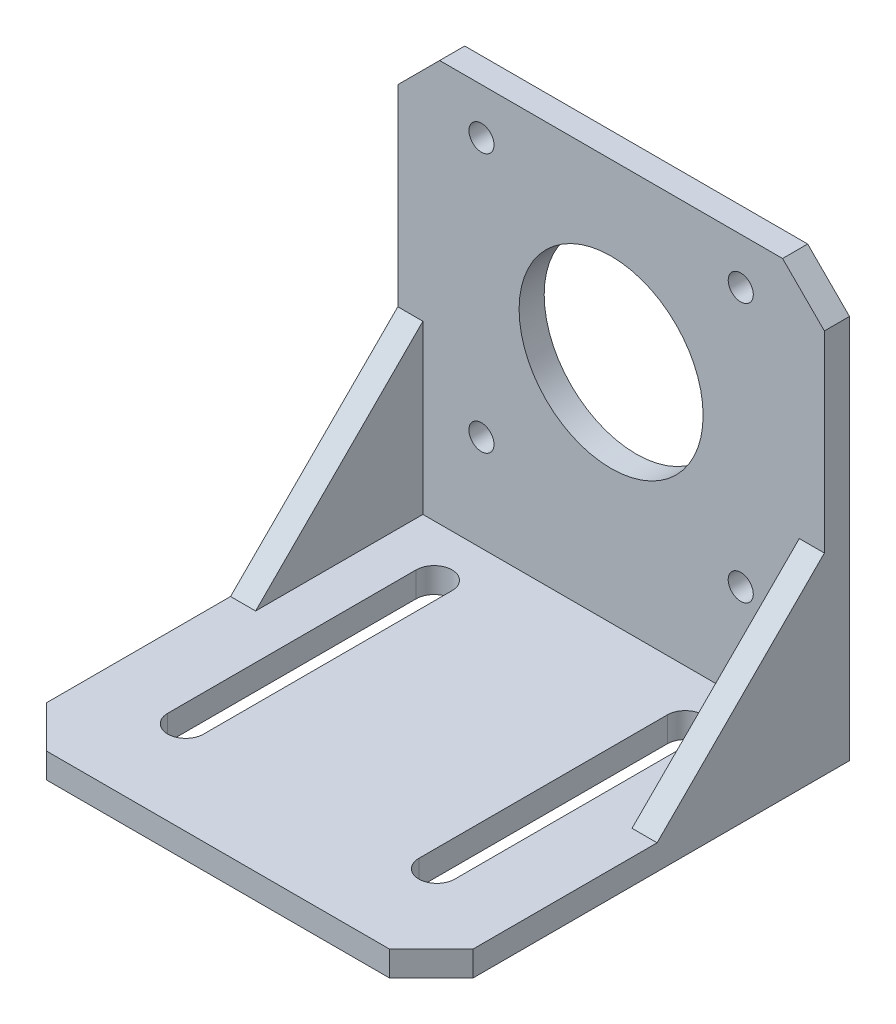
ISO-10303-21;
HEADER;
FILE_DESCRIPTION(('STEP AP214'),'2;1');
FILE_NAME('part.step','',(''),(''),'','','');
FILE_SCHEMA(('AUTOMOTIVE_DESIGN { 1 0 10303 214 1 1 1 1 }'));
ENDSEC;
DATA;
#1=APPLICATION_CONTEXT('core data for automotive mechanical design processes');
#2=APPLICATION_PROTOCOL_DEFINITION('international standard','automotive_design',2000,#1);
#3=PRODUCT_CONTEXT('',#1,'mechanical');
#4=PRODUCT('Part','Part','',(#3));
#5=PRODUCT_RELATED_PRODUCT_CATEGORY('part','',(#4));
#6=PRODUCT_DEFINITION_FORMATION('','',#4);
#7=PRODUCT_DEFINITION_CONTEXT('part definition',#1,'design');
#8=PRODUCT_DEFINITION('design','',#6,#7);
#9=PRODUCT_DEFINITION_SHAPE('','',#8);
#10=(LENGTH_UNIT() NAMED_UNIT(*) SI_UNIT(.MILLI.,.METRE.));
#11=(NAMED_UNIT(*) PLANE_ANGLE_UNIT() SI_UNIT($,.RADIAN.));
#12=(NAMED_UNIT(*) SI_UNIT($,.STERADIAN.) SOLID_ANGLE_UNIT());
#13=UNCERTAINTY_MEASURE_WITH_UNIT(LENGTH_MEASURE(1.E-05),#10,'distance_accuracy_value','');
#14=(GEOMETRIC_REPRESENTATION_CONTEXT(3) GLOBAL_UNCERTAINTY_ASSIGNED_CONTEXT((#13)) GLOBAL_UNIT_ASSIGNED_CONTEXT((#10,
#11,#12)) REPRESENTATION_CONTEXT('',''));
#15=CARTESIAN_POINT('',(0.,0.,0.));
#16=DIRECTION('',(0.,0.,1.));
#17=DIRECTION('',(1.,0.,0.));
#18=AXIS2_PLACEMENT_3D('',#15,#16,#17);
#19=CARTESIAN_POINT('',(0.,3.,0.));
#20=DIRECTION('',(0.,1.,0.));
#21=DIRECTION('',(0.,0.,1.));
#22=AXIS2_PLACEMENT_3D('',#19,#20,#21);
#23=PLANE('',#22);
#24=DIRECTION('',(0.,0.,1.));
#25=VECTOR('',#24,1.);
#26=CARTESIAN_POINT('',(-17.165,3.,-15.85));
#27=LINE('',#26,#25);
#28=CARTESIAN_POINT('',(-17.165,3.,-15.85));
#29=VERTEX_POINT('',#28);
#30=CARTESIAN_POINT('',(-17.165,3.,13.85));
#31=VERTEX_POINT('',#30);
#32=EDGE_CURVE('E301',#29,#31,#27,.T.);
#33=ORIENTED_EDGE('',*,*,#32,.F.);
#34=CARTESIAN_POINT('',(-15.015,3.,-15.85));
#35=DIRECTION('',(0.,1.,0.));
#36=DIRECTION('',(0.,0.,1.));
#37=AXIS2_PLACEMENT_3D('',#34,#35,#36);
#38=CIRCLE('',#37,2.14999999999999);
#39=CARTESIAN_POINT('',(-12.865,3.,-15.85));
#40=VERTEX_POINT('',#39);
#41=EDGE_CURVE('E299',#40,#29,#38,.T.);
#42=ORIENTED_EDGE('',*,*,#41,.F.);
#43=DIRECTION('',(0.,0.,-1.));
#44=VECTOR('',#43,1.);
#45=CARTESIAN_POINT('',(-12.865,3.,-15.85));
#46=LINE('',#45,#44);
#47=CARTESIAN_POINT('',(-12.865,3.,13.85));
#48=VERTEX_POINT('',#47);
#49=EDGE_CURVE('E307',#48,#40,#46,.T.);
#50=ORIENTED_EDGE('',*,*,#49,.F.);
#51=CARTESIAN_POINT('',(-15.015,3.,13.85));
#52=DIRECTION('',(0.,1.,0.));
#53=DIRECTION('',(0.,0.,1.));
#54=AXIS2_PLACEMENT_3D('',#51,#52,#53);
#55=CIRCLE('',#54,2.15000000000001);
#56=EDGE_CURVE('E304',#31,#48,#55,.T.);
#57=ORIENTED_EDGE('',*,*,#56,.F.);
#58=EDGE_LOOP('',(#33,#42,#50,#57));
#59=FACE_BOUND('',#58,.T.);
#60=DIRECTION('',(0.,0.,1.));
#61=VECTOR('',#60,1.);
#62=CARTESIAN_POINT('',(12.865,3.,-15.85));
#63=LINE('',#62,#61);
#64=CARTESIAN_POINT('',(12.865,3.,-15.85));
#65=VERTEX_POINT('',#64);
#66=CARTESIAN_POINT('',(12.865,3.,13.85));
#67=VERTEX_POINT('',#66);
#68=EDGE_CURVE('E270',#65,#67,#63,.T.);
#69=ORIENTED_EDGE('',*,*,#68,.F.);
#70=CARTESIAN_POINT('',(15.015,3.,-15.85));
#71=DIRECTION('',(0.,1.,0.));
#72=DIRECTION('',(0.,0.,-1.));
#73=AXIS2_PLACEMENT_3D('',#70,#71,#72);
#74=CIRCLE('',#73,2.14999999999999);
#75=CARTESIAN_POINT('',(17.165,3.,-15.85));
#76=VERTEX_POINT('',#75);
#77=EDGE_CURVE('E268',#76,#65,#74,.T.);
#78=ORIENTED_EDGE('',*,*,#77,.F.);
#79=DIRECTION('',(0.,0.,-1.));
#80=VECTOR('',#79,1.);
#81=CARTESIAN_POINT('',(17.165,3.,-15.85));
#82=LINE('',#81,#80);
#83=CARTESIAN_POINT('',(17.165,3.,13.85));
#84=VERTEX_POINT('',#83);
#85=EDGE_CURVE('E276',#84,#76,#82,.T.);
#86=ORIENTED_EDGE('',*,*,#85,.F.);
#87=CARTESIAN_POINT('',(15.015,3.,13.85));
#88=DIRECTION('',(0.,1.,0.));
#89=DIRECTION('',(0.,0.,-1.));
#90=AXIS2_PLACEMENT_3D('',#87,#88,#89);
#91=CIRCLE('',#90,2.15000000000001);
#92=EDGE_CURVE('E273',#67,#84,#91,.T.);
#93=ORIENTED_EDGE('',*,*,#92,.F.);
#94=EDGE_LOOP('',(#69,#78,#86,#93));
#95=FACE_BOUND('',#94,.T.);
#96=DIRECTION('',(0.,0.,1.));
#97=VECTOR('',#96,1.);
#98=CARTESIAN_POINT('',(-25.5,3.,25.));
#99=LINE('',#98,#97);
#100=CARTESIAN_POINT('',(-25.5,3.,-2.));
#101=VERTEX_POINT('',#100);
#102=CARTESIAN_POINT('',(-25.5,3.,20.));
#103=VERTEX_POINT('',#102);
#104=EDGE_CURVE('E330',#101,#103,#99,.T.);
#105=ORIENTED_EDGE('',*,*,#104,.T.);
#106=DIRECTION('',(-0.707106781186546,0.,-0.707106781186549));
#107=VECTOR('',#106,1.);
#108=CARTESIAN_POINT('',(-22.75,3.,22.75));
#109=LINE('',#108,#107);
#110=CARTESIAN_POINT('',(-20.5,3.,25.));
#111=VERTEX_POINT('',#110);
#112=EDGE_CURVE('E369',#103,#111,#109,.F.);
#113=ORIENTED_EDGE('',*,*,#112,.T.);
#114=DIRECTION('',(1.,0.,0.));
#115=VECTOR('',#114,1.);
#116=CARTESIAN_POINT('',(25.5,3.,25.));
#117=LINE('',#116,#115);
#118=CARTESIAN_POINT('',(20.5,3.,25.));
#119=VERTEX_POINT('',#118);
#120=EDGE_CURVE('E333',#111,#119,#117,.T.);
#121=ORIENTED_EDGE('',*,*,#120,.T.);
#122=DIRECTION('',(-0.707106781186549,0.,0.707106781186546));
#123=VECTOR('',#122,1.);
#124=CARTESIAN_POINT('',(22.75,3.,22.75));
#125=LINE('',#124,#123);
#126=CARTESIAN_POINT('',(25.5,3.,20.));
#127=VERTEX_POINT('',#126);
#128=EDGE_CURVE('E367',#119,#127,#125,.F.);
#129=ORIENTED_EDGE('',*,*,#128,.T.);
#130=DIRECTION('',(0.,0.,-1.));
#131=VECTOR('',#130,1.);
#132=CARTESIAN_POINT('',(25.5,3.,25.));
#133=LINE('',#132,#131);
#134=CARTESIAN_POINT('',(25.5,3.,-2.));
#135=VERTEX_POINT('',#134);
#136=EDGE_CURVE('E337',#127,#135,#133,.T.);
#137=ORIENTED_EDGE('',*,*,#136,.T.);
#138=DIRECTION('',(1.,0.,0.));
#139=VECTOR('',#138,1.);
#140=CARTESIAN_POINT('',(22.5,3.,-2.));
#141=LINE('',#140,#139);
#142=CARTESIAN_POINT('',(22.5,3.,-2.));
#143=VERTEX_POINT('',#142);
#144=EDGE_CURVE('E201',#143,#135,#141,.T.);
#145=ORIENTED_EDGE('',*,*,#144,.F.);
#146=DIRECTION('',(0.,0.,1.));
#147=VECTOR('',#146,1.);
#148=CARTESIAN_POINT('',(22.5,3.,-2.));
#149=LINE('',#148,#147);
#150=CARTESIAN_POINT('',(22.5,3.,-22.));
#151=VERTEX_POINT('',#150);
#152=EDGE_CURVE('E190',#151,#143,#149,.T.);
#153=ORIENTED_EDGE('',*,*,#152,.F.);
#154=DIRECTION('',(1.,0.,0.));
#155=VECTOR('',#154,1.);
#156=CARTESIAN_POINT('',(0.,3.,-22.));
#157=LINE('',#156,#155);
#158=CARTESIAN_POINT('',(-22.5,3.,-22.));
#159=VERTEX_POINT('',#158);
#160=EDGE_CURVE('E206',#159,#151,#157,.T.);
#161=ORIENTED_EDGE('',*,*,#160,.F.);
#162=DIRECTION('',(0.,0.,1.));
#163=VECTOR('',#162,1.);
#164=CARTESIAN_POINT('',(-22.5,3.,-2.));
#165=LINE('',#164,#163);
#166=CARTESIAN_POINT('',(-22.5,3.,-2.));
#167=VERTEX_POINT('',#166);
#168=EDGE_CURVE('E215',#159,#167,#165,.T.);
#169=ORIENTED_EDGE('',*,*,#168,.T.);
#170=DIRECTION('',(-1.,0.,0.));
#171=VECTOR('',#170,1.);
#172=CARTESIAN_POINT('',(-22.5,3.,-2.));
#173=LINE('',#172,#171);
#174=EDGE_CURVE('E220',#167,#101,#173,.T.);
#175=ORIENTED_EDGE('',*,*,#174,.T.);
#176=EDGE_LOOP('',(#105,#113,#121,#129,#137,#145,#153,#161,#169,#175));
#177=FACE_BOUND('',#176,.T.);
#178=ADVANCED_FACE('F37',(#59,#95,#177),#23,.T.);
#179=CARTESIAN_POINT('',(-25.5,51.,-22.));
#180=DIRECTION('',(0.,0.,1.));
#181=DIRECTION('',(1.,0.,0.));
#182=AXIS2_PLACEMENT_3D('',#179,#180,#181);
#183=PLANE('',#182);
#184=CARTESIAN_POINT('',(15.5,14.5,-22.));
#185=DIRECTION('',(0.,0.,1.));
#186=DIRECTION('',(1.,0.,0.));
#187=AXIS2_PLACEMENT_3D('',#184,#185,#186);
#188=CIRCLE('',#187,1.5);
#189=CARTESIAN_POINT('',(17.,14.5,-22.));
#190=VERTEX_POINT('',#189);
#191=EDGE_CURVE('E226',#190,#190,#188,.T.);
#192=ORIENTED_EDGE('',*,*,#191,.F.);
#193=EDGE_LOOP('',(#192));
#194=FACE_BOUND('',#193,.T.);
#195=CARTESIAN_POINT('',(-15.5,14.5,-22.));
#196=DIRECTION('',(0.,0.,1.));
#197=DIRECTION('',(-1.,0.,0.));
#198=AXIS2_PLACEMENT_3D('',#195,#196,#197);
#199=CIRCLE('',#198,1.5);
#200=CARTESIAN_POINT('',(-17.,14.5,-22.));
#201=VERTEX_POINT('',#200);
#202=EDGE_CURVE('E244',#201,#201,#199,.T.);
#203=ORIENTED_EDGE('',*,*,#202,.F.);
#204=EDGE_LOOP('',(#203));
#205=FACE_BOUND('',#204,.T.);
#206=CARTESIAN_POINT('',(15.5,45.5,-22.));
#207=DIRECTION('',(0.,0.,1.));
#208=DIRECTION('',(-1.,0.,0.));
#209=AXIS2_PLACEMENT_3D('',#206,#207,#208);
#210=CIRCLE('',#209,1.5);
#211=CARTESIAN_POINT('',(14.,45.5,-22.));
#212=VERTEX_POINT('',#211);
#213=EDGE_CURVE('E238',#212,#212,#210,.T.);
#214=ORIENTED_EDGE('',*,*,#213,.F.);
#215=EDGE_LOOP('',(#214));
#216=FACE_BOUND('',#215,.T.);
#217=CARTESIAN_POINT('',(-15.5,45.5,-22.));
#218=DIRECTION('',(0.,0.,1.));
#219=DIRECTION('',(1.,0.,0.));
#220=AXIS2_PLACEMENT_3D('',#217,#218,#219);
#221=CIRCLE('',#220,1.5);
#222=CARTESIAN_POINT('',(-14.,45.5,-22.));
#223=VERTEX_POINT('',#222);
#224=EDGE_CURVE('E232',#223,#223,#221,.T.);
#225=ORIENTED_EDGE('',*,*,#224,.F.);
#226=EDGE_LOOP('',(#225));
#227=FACE_BOUND('',#226,.T.);
#228=CARTESIAN_POINT('',(0.,30.,-22.));
#229=DIRECTION('',(0.,0.,1.));
#230=DIRECTION('',(1.,0.,0.));
#231=AXIS2_PLACEMENT_3D('',#228,#229,#230);
#232=CIRCLE('',#231,11.);
#233=CARTESIAN_POINT('',(11.,30.,-22.));
#234=VERTEX_POINT('',#233);
#235=EDGE_CURVE('E231',#234,#234,#232,.T.);
#236=ORIENTED_EDGE('',*,*,#235,.F.);
#237=EDGE_LOOP('',(#236));
#238=FACE_BOUND('',#237,.T.);
#239=DIRECTION('',(-1.,0.,0.));
#240=VECTOR('',#239,1.);
#241=CARTESIAN_POINT('',(-25.5,51.,-22.));
#242=LINE('',#241,#240);
#243=CARTESIAN_POINT('',(20.5,51.,-22.));
#244=VERTEX_POINT('',#243);
#245=CARTESIAN_POINT('',(-20.5,51.,-22.));
#246=VERTEX_POINT('',#245);
#247=EDGE_CURVE('E260',#244,#246,#242,.T.);
#248=ORIENTED_EDGE('',*,*,#247,.T.);
#249=DIRECTION('',(-0.707106781186549,-0.707106781186546,0.));
#250=VECTOR('',#249,1.);
#251=CARTESIAN_POINT('',(-23.,48.5,-22.));
#252=LINE('',#251,#250);
#253=CARTESIAN_POINT('',(-25.5,46.,-22.));
#254=VERTEX_POINT('',#253);
#255=EDGE_CURVE('E11',#246,#254,#252,.T.);
#256=ORIENTED_EDGE('',*,*,#255,.T.);
#257=DIRECTION('',(0.,-1.,0.));
#258=VECTOR('',#257,1.);
#259=CARTESIAN_POINT('',(-25.5,51.,-22.));
#260=LINE('',#259,#258);
#261=CARTESIAN_POINT('',(-25.5,23.,-22.));
#262=VERTEX_POINT('',#261);
#263=EDGE_CURVE('E263',#254,#262,#260,.T.);
#264=ORIENTED_EDGE('',*,*,#263,.T.);
#265=DIRECTION('',(-1.,0.,0.));
#266=VECTOR('',#265,1.);
#267=CARTESIAN_POINT('',(-22.5,23.,-22.));
#268=LINE('',#267,#266);
#269=CARTESIAN_POINT('',(-22.5,23.,-22.));
#270=VERTEX_POINT('',#269);
#271=EDGE_CURVE('E223',#270,#262,#268,.T.);
#272=ORIENTED_EDGE('',*,*,#271,.F.);
#273=DIRECTION('',(0.,-1.,0.));
#274=VECTOR('',#273,1.);
#275=CARTESIAN_POINT('',(-22.5,3.,-22.));
#276=LINE('',#275,#274);
#277=EDGE_CURVE('E213',#270,#159,#276,.T.);
#278=ORIENTED_EDGE('',*,*,#277,.T.);
#279=ORIENTED_EDGE('',*,*,#160,.T.);
#280=DIRECTION('',(0.,-1.,0.));
#281=VECTOR('',#280,1.);
#282=CARTESIAN_POINT('',(22.5,3.,-22.));
#283=LINE('',#282,#281);
#284=CARTESIAN_POINT('',(22.5,23.,-22.));
#285=VERTEX_POINT('',#284);
#286=EDGE_CURVE('E188',#285,#151,#283,.T.);
#287=ORIENTED_EDGE('',*,*,#286,.F.);
#288=DIRECTION('',(1.,0.,0.));
#289=VECTOR('',#288,1.);
#290=CARTESIAN_POINT('',(22.5,23.,-22.));
#291=LINE('',#290,#289);
#292=CARTESIAN_POINT('',(25.5,23.,-22.));
#293=VERTEX_POINT('',#292);
#294=EDGE_CURVE('E197',#285,#293,#291,.T.);
#295=ORIENTED_EDGE('',*,*,#294,.T.);
#296=DIRECTION('',(0.,-1.,0.));
#297=VECTOR('',#296,1.);
#298=CARTESIAN_POINT('',(25.5,51.,-22.));
#299=LINE('',#298,#297);
#300=CARTESIAN_POINT('',(25.5,46.,-22.));
#301=VERTEX_POINT('',#300);
#302=EDGE_CURVE('E262',#301,#293,#299,.T.);
#303=ORIENTED_EDGE('',*,*,#302,.F.);
#304=DIRECTION('',(-0.707106781186549,0.707106781186546,0.));
#305=VECTOR('',#304,1.);
#306=CARTESIAN_POINT('',(-2.50000000000012,74.,-22.));
#307=LINE('',#306,#305);
#308=EDGE_CURVE('E45',#301,#244,#307,.T.);
#309=ORIENTED_EDGE('',*,*,#308,.T.);
#310=EDGE_LOOP('',(#248,#256,#264,#272,#278,#279,#287,#295,#303,#309));
#311=FACE_BOUND('',#310,.T.);
#312=ADVANCED_FACE('F204',(#194,#205,#216,#227,#238,#311),#183,.T.);
#313=CARTESIAN_POINT('',(0.,0.,0.));
#314=DIRECTION('',(0.,1.,0.));
#315=DIRECTION('',(0.,0.,1.));
#316=AXIS2_PLACEMENT_3D('',#313,#314,#315);
#317=PLANE('',#316);
#318=CARTESIAN_POINT('',(-15.015,0.,-15.85));
#319=DIRECTION('',(0.,1.,0.));
#320=DIRECTION('',(0.,0.,1.));
#321=AXIS2_PLACEMENT_3D('',#318,#319,#320);
#322=CIRCLE('',#321,2.14999999999999);
#323=CARTESIAN_POINT('',(-12.865,0.,-15.85));
#324=VERTEX_POINT('',#323);
#325=CARTESIAN_POINT('',(-17.165,0.,-15.85));
#326=VERTEX_POINT('',#325);
#327=EDGE_CURVE('E298',#324,#326,#322,.T.);
#328=ORIENTED_EDGE('',*,*,#327,.T.);
#329=DIRECTION('',(0.,0.,1.));
#330=VECTOR('',#329,1.);
#331=CARTESIAN_POINT('',(-17.165,0.,-15.85));
#332=LINE('',#331,#330);
#333=CARTESIAN_POINT('',(-17.165,0.,13.85));
#334=VERTEX_POINT('',#333);
#335=EDGE_CURVE('E312',#326,#334,#332,.T.);
#336=ORIENTED_EDGE('',*,*,#335,.T.);
#337=CARTESIAN_POINT('',(-15.015,0.,13.85));
#338=DIRECTION('',(0.,1.,0.));
#339=DIRECTION('',(0.,0.,1.));
#340=AXIS2_PLACEMENT_3D('',#337,#338,#339);
#341=CIRCLE('',#340,2.15000000000001);
#342=CARTESIAN_POINT('',(-12.865,0.,13.85));
#343=VERTEX_POINT('',#342);
#344=EDGE_CURVE('E315',#334,#343,#341,.T.);
#345=ORIENTED_EDGE('',*,*,#344,.T.);
#346=DIRECTION('',(0.,0.,-1.));
#347=VECTOR('',#346,1.);
#348=CARTESIAN_POINT('',(-12.865,0.,-15.85));
#349=LINE('',#348,#347);
#350=EDGE_CURVE('E302',#343,#324,#349,.T.);
#351=ORIENTED_EDGE('',*,*,#350,.T.);
#352=EDGE_LOOP('',(#328,#336,#345,#351));
#353=FACE_BOUND('',#352,.T.);
#354=DIRECTION('',(1.,0.,0.));
#355=VECTOR('',#354,1.);
#356=CARTESIAN_POINT('',(25.5,0.,25.));
#357=LINE('',#356,#355);
#358=CARTESIAN_POINT('',(-20.5,0.,25.));
#359=VERTEX_POINT('',#358);
#360=CARTESIAN_POINT('',(20.5,0.,25.));
#361=VERTEX_POINT('',#360);
#362=EDGE_CURVE('E342',#359,#361,#357,.T.);
#363=ORIENTED_EDGE('',*,*,#362,.F.);
#364=DIRECTION('',(0.707106781186546,0.,0.707106781186549));
#365=VECTOR('',#364,1.);
#366=CARTESIAN_POINT('',(-20.5,0.,25.));
#367=LINE('',#366,#365);
#368=CARTESIAN_POINT('',(-25.5,0.,20.));
#369=VERTEX_POINT('',#368);
#370=EDGE_CURVE('E360',#359,#369,#367,.F.);
#371=ORIENTED_EDGE('',*,*,#370,.T.);
#372=DIRECTION('',(0.,0.,1.));
#373=VECTOR('',#372,1.);
#374=CARTESIAN_POINT('',(-25.5,0.,25.));
#375=LINE('',#374,#373);
#376=CARTESIAN_POINT('',(-25.5,0.,-25.));
#377=VERTEX_POINT('',#376);
#378=EDGE_CURVE('E329',#377,#369,#375,.T.);
#379=ORIENTED_EDGE('',*,*,#378,.F.);
#380=DIRECTION('',(-1.,0.,0.));
#381=VECTOR('',#380,1.);
#382=CARTESIAN_POINT('',(25.5,0.,-25.));
#383=LINE('',#382,#381);
#384=CARTESIAN_POINT('',(25.5,0.,-25.));
#385=VERTEX_POINT('',#384);
#386=EDGE_CURVE('E334',#385,#377,#383,.T.);
#387=ORIENTED_EDGE('',*,*,#386,.F.);
#388=DIRECTION('',(0.,0.,-1.));
#389=VECTOR('',#388,1.);
#390=CARTESIAN_POINT('',(25.5,0.,25.));
#391=LINE('',#390,#389);
#392=CARTESIAN_POINT('',(25.5,0.,20.));
#393=VERTEX_POINT('',#392);
#394=EDGE_CURVE('E345',#393,#385,#391,.T.);
#395=ORIENTED_EDGE('',*,*,#394,.F.);
#396=DIRECTION('',(0.707106781186549,0.,-0.707106781186546));
#397=VECTOR('',#396,1.);
#398=CARTESIAN_POINT('',(25.5,0.,20.));
#399=LINE('',#398,#397);
#400=EDGE_CURVE('E358',#393,#361,#399,.F.);
#401=ORIENTED_EDGE('',*,*,#400,.T.);
#402=EDGE_LOOP('',(#363,#371,#379,#387,#395,#401));
#403=FACE_BOUND('',#402,.T.);
#404=CARTESIAN_POINT('',(15.015,0.,-15.85));
#405=DIRECTION('',(0.,1.,0.));
#406=DIRECTION('',(0.,0.,-1.));
#407=AXIS2_PLACEMENT_3D('',#404,#405,#406);
#408=CIRCLE('',#407,2.14999999999999);
#409=CARTESIAN_POINT('',(17.165,0.,-15.85));
#410=VERTEX_POINT('',#409);
#411=CARTESIAN_POINT('',(12.865,0.,-15.85));
#412=VERTEX_POINT('',#411);
#413=EDGE_CURVE('E267',#410,#412,#408,.T.);
#414=ORIENTED_EDGE('',*,*,#413,.T.);
#415=DIRECTION('',(0.,0.,1.));
#416=VECTOR('',#415,1.);
#417=CARTESIAN_POINT('',(12.865,0.,-15.85));
#418=LINE('',#417,#416);
#419=CARTESIAN_POINT('',(12.865,0.,13.85));
#420=VERTEX_POINT('',#419);
#421=EDGE_CURVE('E281',#412,#420,#418,.T.);
#422=ORIENTED_EDGE('',*,*,#421,.T.);
#423=CARTESIAN_POINT('',(15.015,0.,13.85));
#424=DIRECTION('',(0.,1.,0.));
#425=DIRECTION('',(0.,0.,-1.));
#426=AXIS2_PLACEMENT_3D('',#423,#424,#425);
#427=CIRCLE('',#426,2.15000000000001);
#428=CARTESIAN_POINT('',(17.165,0.,13.85));
#429=VERTEX_POINT('',#428);
#430=EDGE_CURVE('E284',#420,#429,#427,.T.);
#431=ORIENTED_EDGE('',*,*,#430,.T.);
#432=DIRECTION('',(0.,0.,-1.));
#433=VECTOR('',#432,1.);
#434=CARTESIAN_POINT('',(17.165,0.,-15.85));
#435=LINE('',#434,#433);
#436=EDGE_CURVE('E271',#429,#410,#435,.T.);
#437=ORIENTED_EDGE('',*,*,#436,.T.);
#438=EDGE_LOOP('',(#414,#422,#431,#437));
#439=FACE_BOUND('',#438,.T.);
#440=ADVANCED_FACE('F400',(#353,#403,#439),#317,.F.);
#441=CARTESIAN_POINT('',(-25.5,3.,25.));
#442=DIRECTION('',(1.,0.,0.));
#443=DIRECTION('',(0.,0.,-1.));
#444=AXIS2_PLACEMENT_3D('',#441,#442,#443);
#445=PLANE('',#444);
#446=ORIENTED_EDGE('',*,*,#378,.T.);
#447=DIRECTION('',(0.,1.,0.));
#448=VECTOR('',#447,1.);
#449=CARTESIAN_POINT('',(-25.5,3.,20.));
#450=LINE('',#449,#448);
#451=EDGE_CURVE('E365',#369,#103,#450,.T.);
#452=ORIENTED_EDGE('',*,*,#451,.T.);
#453=ORIENTED_EDGE('',*,*,#104,.F.);
#454=DIRECTION('',(0.,0.707106781186548,-0.707106781186548));
#455=VECTOR('',#454,1.);
#456=CARTESIAN_POINT('',(-25.5,23.,-22.));
#457=LINE('',#456,#455);
#458=EDGE_CURVE('E211',#101,#262,#457,.T.);
#459=ORIENTED_EDGE('',*,*,#458,.T.);
#460=ORIENTED_EDGE('',*,*,#263,.F.);
#461=DIRECTION('',(0.,0.,-1.));
#462=VECTOR('',#461,1.);
#463=CARTESIAN_POINT('',(-25.5,46.,-25.));
#464=LINE('',#463,#462);
#465=CARTESIAN_POINT('',(-25.5,46.,-25.));
#466=VERTEX_POINT('',#465);
#467=EDGE_CURVE('E362',#254,#466,#464,.T.);
#468=ORIENTED_EDGE('',*,*,#467,.T.);
#469=DIRECTION('',(0.,-1.,0.));
#470=VECTOR('',#469,1.);
#471=CARTESIAN_POINT('',(-25.5,3.,-25.));
#472=LINE('',#471,#470);
#473=EDGE_CURVE('E339',#466,#377,#472,.T.);
#474=ORIENTED_EDGE('',*,*,#473,.T.);
#475=EDGE_LOOP('',(#446,#452,#453,#459,#460,#468,#474));
#476=FACE_BOUND('',#475,.T.);
#477=ADVANCED_FACE('F404',(#476),#445,.F.);
#478=CARTESIAN_POINT('',(25.5,3.,25.));
#479=DIRECTION('',(0.,0.,-1.));
#480=DIRECTION('',(-1.,0.,0.));
#481=AXIS2_PLACEMENT_3D('',#478,#479,#480);
#482=PLANE('',#481);
#483=ORIENTED_EDGE('',*,*,#120,.F.);
#484=DIRECTION('',(0.,-1.,0.));
#485=VECTOR('',#484,1.);
#486=CARTESIAN_POINT('',(-20.5,3.,25.));
#487=LINE('',#486,#485);
#488=EDGE_CURVE('E355',#111,#359,#487,.T.);
#489=ORIENTED_EDGE('',*,*,#488,.T.);
#490=ORIENTED_EDGE('',*,*,#362,.T.);
#491=DIRECTION('',(0.,1.,0.));
#492=VECTOR('',#491,1.);
#493=CARTESIAN_POINT('',(20.5,3.,25.));
#494=LINE('',#493,#492);
#495=EDGE_CURVE('E353',#361,#119,#494,.T.);
#496=ORIENTED_EDGE('',*,*,#495,.T.);
#497=EDGE_LOOP('',(#483,#489,#490,#496));
#498=FACE_BOUND('',#497,.T.);
#499=ADVANCED_FACE('F414',(#498),#482,.F.);
#500=CARTESIAN_POINT('',(25.5,3.,25.));
#501=DIRECTION('',(-1.,0.,0.));
#502=DIRECTION('',(0.,0.,1.));
#503=AXIS2_PLACEMENT_3D('',#500,#501,#502);
#504=PLANE('',#503);
#505=ORIENTED_EDGE('',*,*,#136,.F.);
#506=DIRECTION('',(0.,-1.,0.));
#507=VECTOR('',#506,1.);
#508=CARTESIAN_POINT('',(25.5,3.,20.));
#509=LINE('',#508,#507);
#510=EDGE_CURVE('E374',#127,#393,#509,.T.);
#511=ORIENTED_EDGE('',*,*,#510,.T.);
#512=ORIENTED_EDGE('',*,*,#394,.T.);
#513=DIRECTION('',(0.,-1.,0.));
#514=VECTOR('',#513,1.);
#515=CARTESIAN_POINT('',(25.5,3.,-25.));
#516=LINE('',#515,#514);
#517=CARTESIAN_POINT('',(25.5,46.,-25.));
#518=VERTEX_POINT('',#517);
#519=EDGE_CURVE('E351',#518,#385,#516,.T.);
#520=ORIENTED_EDGE('',*,*,#519,.F.);
#521=DIRECTION('',(0.,0.,1.));
#522=VECTOR('',#521,1.);
#523=CARTESIAN_POINT('',(25.5,46.,-22.));
#524=LINE('',#523,#522);
#525=EDGE_CURVE('E371',#518,#301,#524,.T.);
#526=ORIENTED_EDGE('',*,*,#525,.T.);
#527=ORIENTED_EDGE('',*,*,#302,.T.);
#528=DIRECTION('',(0.,0.707106781186548,-0.707106781186548));
#529=VECTOR('',#528,1.);
#530=CARTESIAN_POINT('',(25.5,23.,-22.));
#531=LINE('',#530,#529);
#532=EDGE_CURVE('E200',#135,#293,#531,.T.);
#533=ORIENTED_EDGE('',*,*,#532,.F.);
#534=EDGE_LOOP('',(#505,#511,#512,#520,#526,#527,#533));
#535=FACE_BOUND('',#534,.T.);
#536=ADVANCED_FACE('F394',(#535),#504,.F.);
#537=CARTESIAN_POINT('',(25.5,3.,-25.));
#538=DIRECTION('',(0.,0.,1.));
#539=DIRECTION('',(1.,0.,0.));
#540=AXIS2_PLACEMENT_3D('',#537,#538,#539);
#541=PLANE('',#540);
#542=CARTESIAN_POINT('',(15.5,14.5,-25.));
#543=DIRECTION('',(0.,0.,1.));
#544=DIRECTION('',(1.,0.,0.));
#545=AXIS2_PLACEMENT_3D('',#542,#543,#544);
#546=CIRCLE('',#545,1.5);
#547=CARTESIAN_POINT('',(17.,14.5,-25.));
#548=VERTEX_POINT('',#547);
#549=EDGE_CURVE('E247',#548,#548,#546,.T.);
#550=ORIENTED_EDGE('',*,*,#549,.T.);
#551=EDGE_LOOP('',(#550));
#552=FACE_BOUND('',#551,.T.);
#553=CARTESIAN_POINT('',(-15.5,14.5,-25.));
#554=DIRECTION('',(0.,0.,1.));
#555=DIRECTION('',(-1.,0.,0.));
#556=AXIS2_PLACEMENT_3D('',#553,#554,#555);
#557=CIRCLE('',#556,1.5);
#558=CARTESIAN_POINT('',(-17.,14.5,-25.));
#559=VERTEX_POINT('',#558);
#560=EDGE_CURVE('E241',#559,#559,#557,.T.);
#561=ORIENTED_EDGE('',*,*,#560,.T.);
#562=EDGE_LOOP('',(#561));
#563=FACE_BOUND('',#562,.T.);
#564=CARTESIAN_POINT('',(15.5,45.5,-25.));
#565=DIRECTION('',(0.,0.,1.));
#566=DIRECTION('',(-1.,0.,0.));
#567=AXIS2_PLACEMENT_3D('',#564,#565,#566);
#568=CIRCLE('',#567,1.5);
#569=CARTESIAN_POINT('',(14.,45.5,-25.));
#570=VERTEX_POINT('',#569);
#571=EDGE_CURVE('E235',#570,#570,#568,.T.);
#572=ORIENTED_EDGE('',*,*,#571,.T.);
#573=EDGE_LOOP('',(#572));
#574=FACE_BOUND('',#573,.T.);
#575=CARTESIAN_POINT('',(-15.5,45.5,-25.));
#576=DIRECTION('',(0.,0.,1.));
#577=DIRECTION('',(1.,0.,0.));
#578=AXIS2_PLACEMENT_3D('',#575,#576,#577);
#579=CIRCLE('',#578,1.5);
#580=CARTESIAN_POINT('',(-14.,45.5,-25.));
#581=VERTEX_POINT('',#580);
#582=EDGE_CURVE('E228',#581,#581,#579,.T.);
#583=ORIENTED_EDGE('',*,*,#582,.T.);
#584=EDGE_LOOP('',(#583));
#585=FACE_BOUND('',#584,.T.);
#586=CARTESIAN_POINT('',(0.,30.,-25.));
#587=DIRECTION('',(0.,0.,1.));
#588=DIRECTION('',(1.,0.,0.));
#589=AXIS2_PLACEMENT_3D('',#586,#587,#588);
#590=CIRCLE('',#589,11.);
#591=CARTESIAN_POINT('',(11.,30.,-25.));
#592=VERTEX_POINT('',#591);
#593=EDGE_CURVE('E252',#592,#592,#590,.T.);
#594=ORIENTED_EDGE('',*,*,#593,.T.);
#595=EDGE_LOOP('',(#594));
#596=FACE_BOUND('',#595,.T.);
#597=ORIENTED_EDGE('',*,*,#473,.F.);
#598=DIRECTION('',(0.707106781186549,0.707106781186546,0.));
#599=VECTOR('',#598,1.);
#600=CARTESIAN_POINT('',(-25.5,46.,-25.));
#601=LINE('',#600,#599);
#602=CARTESIAN_POINT('',(-20.5,51.,-25.));
#603=VERTEX_POINT('',#602);
#604=EDGE_CURVE('E379',#466,#603,#601,.T.);
#605=ORIENTED_EDGE('',*,*,#604,.T.);
#606=DIRECTION('',(1.,0.,0.));
#607=VECTOR('',#606,1.);
#608=CARTESIAN_POINT('',(-25.5,51.,-25.));
#609=LINE('',#608,#607);
#610=CARTESIAN_POINT('',(20.5,51.,-25.));
#611=VERTEX_POINT('',#610);
#612=EDGE_CURVE('E255',#603,#611,#609,.T.);
#613=ORIENTED_EDGE('',*,*,#612,.T.);
#614=DIRECTION('',(0.707106781186549,-0.707106781186546,0.));
#615=VECTOR('',#614,1.);
#616=CARTESIAN_POINT('',(25.5,46.,-25.));
#617=LINE('',#616,#615);
#618=EDGE_CURVE('E377',#611,#518,#617,.T.);
#619=ORIENTED_EDGE('',*,*,#618,.T.);
#620=ORIENTED_EDGE('',*,*,#519,.T.);
#621=ORIENTED_EDGE('',*,*,#386,.T.);
#622=EDGE_LOOP('',(#597,#605,#613,#619,#620,#621));
#623=FACE_BOUND('',#622,.T.);
#624=ADVANCED_FACE('F389',(#552,#563,#574,#585,#596,#623),#541,.F.);
#625=CARTESIAN_POINT('',(-15.015,3.,-15.85));
#626=DIRECTION('',(0.,-1.,0.));
#627=DIRECTION('',(0.,0.,-1.));
#628=AXIS2_PLACEMENT_3D('',#625,#626,#627);
#629=CYLINDRICAL_SURFACE('',#628,2.14999999999999);
#630=ORIENTED_EDGE('',*,*,#327,.F.);
#631=DIRECTION('',(0.,-1.,0.));
#632=VECTOR('',#631,1.);
#633=CARTESIAN_POINT('',(-12.865,3.,-15.85));
#634=LINE('',#633,#632);
#635=EDGE_CURVE('E309',#40,#324,#634,.T.);
#636=ORIENTED_EDGE('',*,*,#635,.F.);
#637=ORIENTED_EDGE('',*,*,#41,.T.);
#638=DIRECTION('',(0.,-1.,0.));
#639=VECTOR('',#638,1.);
#640=CARTESIAN_POINT('',(-17.165,3.,-15.85));
#641=LINE('',#640,#639);
#642=EDGE_CURVE('E326',#29,#326,#641,.T.);
#643=ORIENTED_EDGE('',*,*,#642,.T.);
#644=EDGE_LOOP('',(#630,#636,#637,#643));
#645=FACE_BOUND('',#644,.T.);
#646=ADVANCED_FACE('F451',(#645),#629,.F.);
#647=CARTESIAN_POINT('',(-17.165,3.,-15.85));
#648=DIRECTION('',(1.,0.,0.));
#649=DIRECTION('',(0.,0.,-1.));
#650=AXIS2_PLACEMENT_3D('',#647,#648,#649);
#651=PLANE('',#650);
#652=ORIENTED_EDGE('',*,*,#335,.F.);
#653=ORIENTED_EDGE('',*,*,#642,.F.);
#654=ORIENTED_EDGE('',*,*,#32,.T.);
#655=DIRECTION('',(0.,-1.,0.));
#656=VECTOR('',#655,1.);
#657=CARTESIAN_POINT('',(-17.165,3.,13.85));
#658=LINE('',#657,#656);
#659=EDGE_CURVE('E324',#31,#334,#658,.T.);
#660=ORIENTED_EDGE('',*,*,#659,.T.);
#661=EDGE_LOOP('',(#652,#653,#654,#660));
#662=FACE_BOUND('',#661,.T.);
#663=ADVANCED_FACE('F523',(#662),#651,.T.);
#664=CARTESIAN_POINT('',(-15.015,3.,13.85));
#665=DIRECTION('',(0.,-1.,0.));
#666=DIRECTION('',(0.,0.,-1.));
#667=AXIS2_PLACEMENT_3D('',#664,#665,#666);
#668=CYLINDRICAL_SURFACE('',#667,2.15000000000001);
#669=ORIENTED_EDGE('',*,*,#344,.F.);
#670=ORIENTED_EDGE('',*,*,#659,.F.);
#671=ORIENTED_EDGE('',*,*,#56,.T.);
#672=DIRECTION('',(0.,-1.,0.));
#673=VECTOR('',#672,1.);
#674=CARTESIAN_POINT('',(-12.865,3.,13.85));
#675=LINE('',#674,#673);
#676=EDGE_CURVE('E322',#48,#343,#675,.T.);
#677=ORIENTED_EDGE('',*,*,#676,.T.);
#678=EDGE_LOOP('',(#669,#670,#671,#677));
#679=FACE_BOUND('',#678,.T.);
#680=ADVANCED_FACE('F520',(#679),#668,.F.);
#681=CARTESIAN_POINT('',(-12.865,3.,-15.85));
#682=DIRECTION('',(-1.,0.,0.));
#683=DIRECTION('',(0.,0.,1.));
#684=AXIS2_PLACEMENT_3D('',#681,#682,#683);
#685=PLANE('',#684);
#686=ORIENTED_EDGE('',*,*,#350,.F.);
#687=ORIENTED_EDGE('',*,*,#676,.F.);
#688=ORIENTED_EDGE('',*,*,#49,.T.);
#689=ORIENTED_EDGE('',*,*,#635,.T.);
#690=EDGE_LOOP('',(#686,#687,#688,#689));
#691=FACE_BOUND('',#690,.T.);
#692=ADVANCED_FACE('F516',(#691),#685,.T.);
#693=CARTESIAN_POINT('',(15.015,3.,-15.85));
#694=DIRECTION('',(0.,-1.,0.));
#695=DIRECTION('',(0.,0.,-1.));
#696=AXIS2_PLACEMENT_3D('',#693,#694,#695);
#697=CYLINDRICAL_SURFACE('',#696,2.14999999999999);
#698=ORIENTED_EDGE('',*,*,#413,.F.);
#699=DIRECTION('',(0.,-1.,0.));
#700=VECTOR('',#699,1.);
#701=CARTESIAN_POINT('',(17.165,3.,-15.85));
#702=LINE('',#701,#700);
#703=EDGE_CURVE('E278',#76,#410,#702,.T.);
#704=ORIENTED_EDGE('',*,*,#703,.F.);
#705=ORIENTED_EDGE('',*,*,#77,.T.);
#706=DIRECTION('',(0.,-1.,0.));
#707=VECTOR('',#706,1.);
#708=CARTESIAN_POINT('',(12.865,3.,-15.85));
#709=LINE('',#708,#707);
#710=EDGE_CURVE('E295',#65,#412,#709,.T.);
#711=ORIENTED_EDGE('',*,*,#710,.T.);
#712=EDGE_LOOP('',(#698,#704,#705,#711));
#713=FACE_BOUND('',#712,.T.);
#714=ADVANCED_FACE('F512',(#713),#697,.F.);
#715=CARTESIAN_POINT('',(12.865,3.,-15.85));
#716=DIRECTION('',(1.,0.,0.));
#717=DIRECTION('',(0.,0.,-1.));
#718=AXIS2_PLACEMENT_3D('',#715,#716,#717);
#719=PLANE('',#718);
#720=ORIENTED_EDGE('',*,*,#421,.F.);
#721=ORIENTED_EDGE('',*,*,#710,.F.);
#722=ORIENTED_EDGE('',*,*,#68,.T.);
#723=DIRECTION('',(0.,-1.,0.));
#724=VECTOR('',#723,1.);
#725=CARTESIAN_POINT('',(12.865,3.,13.85));
#726=LINE('',#725,#724);
#727=EDGE_CURVE('E293',#67,#420,#726,.T.);
#728=ORIENTED_EDGE('',*,*,#727,.T.);
#729=EDGE_LOOP('',(#720,#721,#722,#728));
#730=FACE_BOUND('',#729,.T.);
#731=ADVANCED_FACE('F508',(#730),#719,.T.);
#732=CARTESIAN_POINT('',(15.015,3.,13.85));
#733=DIRECTION('',(0.,-1.,0.));
#734=DIRECTION('',(0.,0.,-1.));
#735=AXIS2_PLACEMENT_3D('',#732,#733,#734);
#736=CYLINDRICAL_SURFACE('',#735,2.15000000000001);
#737=ORIENTED_EDGE('',*,*,#430,.F.);
#738=ORIENTED_EDGE('',*,*,#727,.F.);
#739=ORIENTED_EDGE('',*,*,#92,.T.);
#740=DIRECTION('',(0.,-1.,0.));
#741=VECTOR('',#740,1.);
#742=CARTESIAN_POINT('',(17.165,3.,13.85));
#743=LINE('',#742,#741);
#744=EDGE_CURVE('E291',#84,#429,#743,.T.);
#745=ORIENTED_EDGE('',*,*,#744,.T.);
#746=EDGE_LOOP('',(#737,#738,#739,#745));
#747=FACE_BOUND('',#746,.T.);
#748=ADVANCED_FACE('F504',(#747),#736,.F.);
#749=CARTESIAN_POINT('',(17.165,3.,-15.85));
#750=DIRECTION('',(-1.,0.,0.));
#751=DIRECTION('',(0.,0.,1.));
#752=AXIS2_PLACEMENT_3D('',#749,#750,#751);
#753=PLANE('',#752);
#754=ORIENTED_EDGE('',*,*,#436,.F.);
#755=ORIENTED_EDGE('',*,*,#744,.F.);
#756=ORIENTED_EDGE('',*,*,#85,.T.);
#757=ORIENTED_EDGE('',*,*,#703,.T.);
#758=EDGE_LOOP('',(#754,#755,#756,#757));
#759=FACE_BOUND('',#758,.T.);
#760=ADVANCED_FACE('F500',(#759),#753,.T.);
#761=CARTESIAN_POINT('',(0.,51.,0.));
#762=DIRECTION('',(0.,1.,0.));
#763=DIRECTION('',(0.,0.,1.));
#764=AXIS2_PLACEMENT_3D('',#761,#762,#763);
#765=PLANE('',#764);
#766=ORIENTED_EDGE('',*,*,#612,.F.);
#767=DIRECTION('',(0.,0.,1.));
#768=VECTOR('',#767,1.);
#769=CARTESIAN_POINT('',(-20.5,51.,-22.));
#770=LINE('',#769,#768);
#771=EDGE_CURVE('E52',#603,#246,#770,.T.);
#772=ORIENTED_EDGE('',*,*,#771,.T.);
#773=ORIENTED_EDGE('',*,*,#247,.F.);
#774=DIRECTION('',(0.,0.,-1.));
#775=VECTOR('',#774,1.);
#776=CARTESIAN_POINT('',(20.5,51.,-25.));
#777=LINE('',#776,#775);
#778=EDGE_CURVE('E381',#244,#611,#777,.T.);
#779=ORIENTED_EDGE('',*,*,#778,.T.);
#780=EDGE_LOOP('',(#766,#772,#773,#779));
#781=FACE_BOUND('',#780,.T.);
#782=ADVANCED_FACE('F384',(#781),#765,.T.);
#783=CARTESIAN_POINT('',(0.,30.,-25.));
#784=DIRECTION('',(0.,0.,1.));
#785=DIRECTION('',(1.,0.,0.));
#786=AXIS2_PLACEMENT_3D('',#783,#784,#785);
#787=CYLINDRICAL_SURFACE('',#786,11.);
#788=ORIENTED_EDGE('',*,*,#593,.F.);
#789=EDGE_LOOP('',(#788));
#790=FACE_BOUND('',#789,.T.);
#791=ORIENTED_EDGE('',*,*,#235,.T.);
#792=EDGE_LOOP('',(#791));
#793=FACE_BOUND('',#792,.T.);
#794=ADVANCED_FACE('F484',(#790,#793),#787,.F.);
#795=CARTESIAN_POINT('',(-15.5,45.5,-25.));
#796=DIRECTION('',(0.,0.,1.));
#797=DIRECTION('',(1.,0.,0.));
#798=AXIS2_PLACEMENT_3D('',#795,#796,#797);
#799=CYLINDRICAL_SURFACE('',#798,1.5);
#800=ORIENTED_EDGE('',*,*,#582,.F.);
#801=EDGE_LOOP('',(#800));
#802=FACE_BOUND('',#801,.T.);
#803=ORIENTED_EDGE('',*,*,#224,.T.);
#804=EDGE_LOOP('',(#803));
#805=FACE_BOUND('',#804,.T.);
#806=ADVANCED_FACE('F480',(#802,#805),#799,.F.);
#807=CARTESIAN_POINT('',(15.5,45.5,-25.));
#808=DIRECTION('',(0.,0.,1.));
#809=DIRECTION('',(1.,0.,0.));
#810=AXIS2_PLACEMENT_3D('',#807,#808,#809);
#811=CYLINDRICAL_SURFACE('',#810,1.5);
#812=ORIENTED_EDGE('',*,*,#571,.F.);
#813=EDGE_LOOP('',(#812));
#814=FACE_BOUND('',#813,.T.);
#815=ORIENTED_EDGE('',*,*,#213,.T.);
#816=EDGE_LOOP('',(#815));
#817=FACE_BOUND('',#816,.T.);
#818=ADVANCED_FACE('F483',(#814,#817),#811,.F.);
#819=CARTESIAN_POINT('',(-15.5,14.5,-25.));
#820=DIRECTION('',(0.,0.,1.));
#821=DIRECTION('',(1.,0.,0.));
#822=AXIS2_PLACEMENT_3D('',#819,#820,#821);
#823=CYLINDRICAL_SURFACE('',#822,1.5);
#824=ORIENTED_EDGE('',*,*,#560,.F.);
#825=EDGE_LOOP('',(#824));
#826=FACE_BOUND('',#825,.T.);
#827=ORIENTED_EDGE('',*,*,#202,.T.);
#828=EDGE_LOOP('',(#827));
#829=FACE_BOUND('',#828,.T.);
#830=ADVANCED_FACE('F488',(#826,#829),#823,.F.);
#831=CARTESIAN_POINT('',(15.5,14.5,-25.));
#832=DIRECTION('',(0.,0.,1.));
#833=DIRECTION('',(1.,0.,0.));
#834=AXIS2_PLACEMENT_3D('',#831,#832,#833);
#835=CYLINDRICAL_SURFACE('',#834,1.5);
#836=ORIENTED_EDGE('',*,*,#549,.F.);
#837=EDGE_LOOP('',(#836));
#838=FACE_BOUND('',#837,.T.);
#839=ORIENTED_EDGE('',*,*,#191,.T.);
#840=EDGE_LOOP('',(#839));
#841=FACE_BOUND('',#840,.T.);
#842=ADVANCED_FACE('F479',(#838,#841),#835,.F.);
#843=CARTESIAN_POINT('',(-22.5,23.,-22.));
#844=DIRECTION('',(0.,0.707106781186547,0.707106781186547));
#845=DIRECTION('',(0.,-0.707106781186548,0.707106781186548));
#846=AXIS2_PLACEMENT_3D('',#843,#844,#845);
#847=PLANE('',#846);
#848=ORIENTED_EDGE('',*,*,#458,.F.);
#849=ORIENTED_EDGE('',*,*,#174,.F.);
#850=DIRECTION('',(0.,0.707106781186548,-0.707106781186548));
#851=VECTOR('',#850,1.);
#852=CARTESIAN_POINT('',(-22.5,23.,-22.));
#853=LINE('',#852,#851);
#854=EDGE_CURVE('E217',#167,#270,#853,.T.);
#855=ORIENTED_EDGE('',*,*,#854,.T.);
#856=ORIENTED_EDGE('',*,*,#271,.T.);
#857=EDGE_LOOP('',(#848,#849,#855,#856));
#858=FACE_BOUND('',#857,.T.);
#859=ADVANCED_FACE('F427',(#858),#847,.T.);
#860=CARTESIAN_POINT('',(-22.5,0.,0.));
#861=DIRECTION('',(-1.,0.,0.));
#862=DIRECTION('',(0.,0.,1.));
#863=AXIS2_PLACEMENT_3D('',#860,#861,#862);
#864=PLANE('',#863);
#865=ORIENTED_EDGE('',*,*,#277,.F.);
#866=ORIENTED_EDGE('',*,*,#854,.F.);
#867=ORIENTED_EDGE('',*,*,#168,.F.);
#868=EDGE_LOOP('',(#865,#866,#867));
#869=FACE_BOUND('',#868,.T.);
#870=ADVANCED_FACE('F424',(#869),#864,.F.);
#871=CARTESIAN_POINT('',(22.5,23.,-22.));
#872=DIRECTION('',(0.,-0.707106781186547,-0.707106781186547));
#873=DIRECTION('',(0.,0.707106781186548,-0.707106781186548));
#874=AXIS2_PLACEMENT_3D('',#871,#872,#873);
#875=PLANE('',#874);
#876=ORIENTED_EDGE('',*,*,#532,.T.);
#877=ORIENTED_EDGE('',*,*,#294,.F.);
#878=DIRECTION('',(0.,0.707106781186548,-0.707106781186548));
#879=VECTOR('',#878,1.);
#880=CARTESIAN_POINT('',(22.5,23.,-22.));
#881=LINE('',#880,#879);
#882=EDGE_CURVE('E184',#143,#285,#881,.T.);
#883=ORIENTED_EDGE('',*,*,#882,.F.);
#884=ORIENTED_EDGE('',*,*,#144,.T.);
#885=EDGE_LOOP('',(#876,#877,#883,#884));
#886=FACE_BOUND('',#885,.T.);
#887=ADVANCED_FACE('F198',(#886),#875,.F.);
#888=CARTESIAN_POINT('',(22.5,0.,0.));
#889=DIRECTION('',(1.,0.,0.));
#890=DIRECTION('',(0.,0.,1.));
#891=AXIS2_PLACEMENT_3D('',#888,#889,#890);
#892=PLANE('',#891);
#893=ORIENTED_EDGE('',*,*,#286,.T.);
#894=ORIENTED_EDGE('',*,*,#152,.T.);
#895=ORIENTED_EDGE('',*,*,#882,.T.);
#896=EDGE_LOOP('',(#893,#894,#895));
#897=FACE_BOUND('',#896,.T.);
#898=ADVANCED_FACE('F186',(#897),#892,.F.);
#899=CARTESIAN_POINT('',(-20.5,3.,25.));
#900=DIRECTION('',(0.707106781186549,0.,-0.707106781186546));
#901=DIRECTION('',(0.,-1.,0.));
#902=AXIS2_PLACEMENT_3D('',#899,#900,#901);
#903=PLANE('',#902);
#904=ORIENTED_EDGE('',*,*,#112,.F.);
#905=ORIENTED_EDGE('',*,*,#451,.F.);
#906=ORIENTED_EDGE('',*,*,#370,.F.);
#907=ORIENTED_EDGE('',*,*,#488,.F.);
#908=EDGE_LOOP('',(#904,#905,#906,#907));
#909=FACE_BOUND('',#908,.T.);
#910=ADVANCED_FACE('F408',(#909),#903,.F.);
#911=CARTESIAN_POINT('',(25.5,3.,20.));
#912=DIRECTION('',(-0.707106781186546,0.,-0.707106781186549));
#913=DIRECTION('',(0.,-1.,0.));
#914=AXIS2_PLACEMENT_3D('',#911,#912,#913);
#915=PLANE('',#914);
#916=ORIENTED_EDGE('',*,*,#128,.F.);
#917=ORIENTED_EDGE('',*,*,#495,.F.);
#918=ORIENTED_EDGE('',*,*,#400,.F.);
#919=ORIENTED_EDGE('',*,*,#510,.F.);
#920=EDGE_LOOP('',(#916,#917,#918,#919));
#921=FACE_BOUND('',#920,.T.);
#922=ADVANCED_FACE('F417',(#921),#915,.F.);
#923=CARTESIAN_POINT('',(-25.5,46.,25.));
#924=DIRECTION('',(-0.707106781186546,0.707106781186549,0.));
#925=DIRECTION('',(0.,0.,1.));
#926=AXIS2_PLACEMENT_3D('',#923,#924,#925);
#927=PLANE('',#926);
#928=ORIENTED_EDGE('',*,*,#255,.F.);
#929=ORIENTED_EDGE('',*,*,#771,.F.);
#930=ORIENTED_EDGE('',*,*,#604,.F.);
#931=ORIENTED_EDGE('',*,*,#467,.F.);
#932=EDGE_LOOP('',(#928,#929,#930,#931));
#933=FACE_BOUND('',#932,.T.);
#934=ADVANCED_FACE('F432',(#933),#927,.T.);
#935=CARTESIAN_POINT('',(25.5,46.,25.));
#936=DIRECTION('',(0.707106781186546,0.707106781186549,0.));
#937=DIRECTION('',(0.,0.,-1.));
#938=AXIS2_PLACEMENT_3D('',#935,#936,#937);
#939=PLANE('',#938);
#940=ORIENTED_EDGE('',*,*,#618,.F.);
#941=ORIENTED_EDGE('',*,*,#778,.F.);
#942=ORIENTED_EDGE('',*,*,#308,.F.);
#943=ORIENTED_EDGE('',*,*,#525,.F.);
#944=EDGE_LOOP('',(#940,#941,#942,#943));
#945=FACE_BOUND('',#944,.T.);
#946=ADVANCED_FACE('F39',(#945),#939,.T.);
#947=CLOSED_SHELL('',(#178,#312,#440,#477,#499,#536,#624,#646,#663,#680,#692,#714,#731,#748,
#760,#782,#794,#806,#818,#830,#842,#859,#870,#887,#898,#910,#922,#934,#946));
#948=MANIFOLD_SOLID_BREP('B2',#947);
#949=ADVANCED_BREP_SHAPE_REPRESENTATION('',(#18,#948),#14);
#950=SHAPE_DEFINITION_REPRESENTATION(#9,#949);
ENDSEC;
END-ISO-10303-21;
